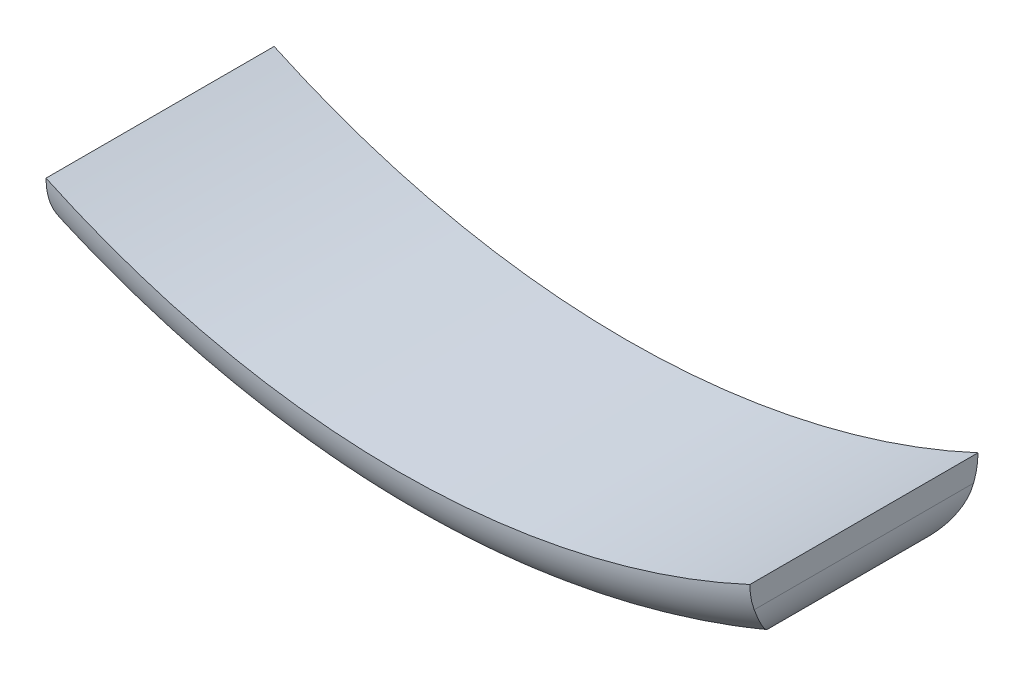
ISO-10303-21;
HEADER;
FILE_DESCRIPTION(('STEP AP214'),'2;1');
FILE_NAME('part.step','',(''),(''),'','','');
FILE_SCHEMA(('AUTOMOTIVE_DESIGN { 1 0 10303 214 1 1 1 1 }'));
ENDSEC;
DATA;
#1=APPLICATION_CONTEXT('core data for automotive mechanical design processes');
#2=APPLICATION_PROTOCOL_DEFINITION('international standard','automotive_design',2000,#1);
#3=PRODUCT_CONTEXT('',#1,'mechanical');
#4=PRODUCT('Part','Part','',(#3));
#5=PRODUCT_RELATED_PRODUCT_CATEGORY('part','',(#4));
#6=PRODUCT_DEFINITION_FORMATION('','',#4);
#7=PRODUCT_DEFINITION_CONTEXT('part definition',#1,'design');
#8=PRODUCT_DEFINITION('design','',#6,#7);
#9=PRODUCT_DEFINITION_SHAPE('','',#8);
#10=(LENGTH_UNIT() NAMED_UNIT(*) SI_UNIT(.MILLI.,.METRE.));
#11=(NAMED_UNIT(*) PLANE_ANGLE_UNIT() SI_UNIT($,.RADIAN.));
#12=(NAMED_UNIT(*) SI_UNIT($,.STERADIAN.) SOLID_ANGLE_UNIT());
#13=UNCERTAINTY_MEASURE_WITH_UNIT(LENGTH_MEASURE(1.E-05),#10,'distance_accuracy_value','');
#14=(GEOMETRIC_REPRESENTATION_CONTEXT(3) GLOBAL_UNCERTAINTY_ASSIGNED_CONTEXT((#13)) GLOBAL_UNIT_ASSIGNED_CONTEXT((#10,
#11,#12)) REPRESENTATION_CONTEXT('',''));
#15=CARTESIAN_POINT('',(0.,0.,0.));
#16=DIRECTION('',(0.,0.,1.));
#17=DIRECTION('',(1.,0.,0.));
#18=AXIS2_PLACEMENT_3D('',#15,#16,#17);
#19=CARTESIAN_POINT('',(-51.702266214,-136.538916314,-790.533090717));
#20=DIRECTION('',(0.,0.,-1.));
#21=DIRECTION('',(-1.,0.,0.));
#22=AXIS2_PLACEMENT_3D('',#19,#20,#21);
#23=CYLINDRICAL_SURFACE('',#22,9.99999999999999);
#24=DIRECTION('',(0.,0.,-1.));
#25=VECTOR('',#24,1.);
#26=CARTESIAN_POINT('',(-61.702266214,-136.538916314,-810.));
#27=LINE('',#26,#25);
#28=CARTESIAN_POINT('',(-61.702266214,-136.538916315781,-790.76392363358));
#29=VERTEX_POINT('',#28);
#30=CARTESIAN_POINT('',(-61.702266214,-136.538916317559,-829.236076365633));
#31=VERTEX_POINT('',#30);
#32=EDGE_CURVE('E142',#29,#31,#27,.T.);
#33=ORIENTED_EDGE('',*,*,#32,.T.);
#34=CARTESIAN_POINT('',(-61.702266214,-136.538916317559,-829.236076365633));
#35=CARTESIAN_POINT('',(-61.7022578830513,-136.828520241543,-829.126528882545));
#36=CARTESIAN_POINT('',(-61.6896873358878,-137.114051119616,-829.007383095938));
#37=CARTESIAN_POINT('',(-61.6415030216038,-137.675010277773,-828.752568023705));
#38=CARTESIAN_POINT('',(-61.6059340190415,-137.950457087493,-828.616931251941));
#39=CARTESIAN_POINT('',(-61.4687347356689,-138.754698450711,-828.191600548354));
#40=CARTESIAN_POINT('',(-61.3365206829346,-139.267566563795,-827.881066705212));
#41=CARTESIAN_POINT('',(-61.0661158461681,-140.063839140127,-827.341924613336));
#42=CARTESIAN_POINT('',(-60.9478163594744,-140.362535553281,-827.12491949173));
#43=CARTESIAN_POINT('',(-60.6875677874012,-140.93941073979,-826.677992277264));
#44=CARTESIAN_POINT('',(-60.5456162075812,-141.217587344578,-826.448068823684));
#45=CARTESIAN_POINT('',(-60.2401193763442,-141.754373854221,-825.97670129254));
#46=CARTESIAN_POINT('',(-60.0764632226454,-142.012871744594,-825.735202413881));
#47=CARTESIAN_POINT('',(-59.730587357344,-142.508622809219,-825.24389607616));
#48=CARTESIAN_POINT('',(-59.5483667100029,-142.745874911449,-824.994088198712));
#49=CARTESIAN_POINT('',(-59.1113508965469,-143.265902770107,-824.413337734968));
#50=CARTESIAN_POINT('',(-58.8509830645023,-143.541517833563,-824.080160204912));
#51=CARTESIAN_POINT('',(-58.3064284215977,-144.057276113727,-823.405791980209));
#52=CARTESIAN_POINT('',(-58.0222327863062,-144.297406097067,-823.064598350836));
#53=CARTESIAN_POINT('',(-57.434099251549,-144.741445520952,-822.377765160084));
#54=CARTESIAN_POINT('',(-57.1302167892222,-144.945451106927,-822.032140108124));
#55=CARTESIAN_POINT('',(-56.5049036146386,-145.317697046669,-821.33788475067));
#56=CARTESIAN_POINT('',(-56.183482081657,-145.485955887497,-820.989256096096));
#57=CARTESIAN_POINT('',(-55.658079739762,-145.725762099704,-820.431638768852));
#58=CARTESIAN_POINT('',(-55.4589744206364,-145.808956797107,-820.222997961991));
#59=CARTESIAN_POINT('',(-55.2527798441159,-145.887385572661,-820.009582821839));
#60=CARTESIAN_POINT('',(-55.2481492316041,-145.889142949817,-820.004791405609));
#61=CARTESIAN_POINT('',(-55.2435173244383,-145.890896883343,-820.000000000935));
#62=B_SPLINE_CURVE_WITH_KNOTS('',3,(#34,#35,#36,#37,#38,#39,#40,#41,#42,#43,#44,#45,#46,#47,#48,
#49,#50,#51,#52,#53,#54,#55,#56,#57,#58,#59,#60,#61),.UNSPECIFIED.,.F.,.F.,(4,2,2,2,2,2,2,2,2,2,
2,2,2,4),(0.,0.927784787002352,1.85376913309444,3.6861443693414,4.84799603119947,
6.00997030403513,7.17812868224406,8.34634597033063,9.85848511811007,11.3711867689943,
12.879799771713,14.3876306589878,15.2877806604668,15.3084542518855),.UNSPECIFIED.);
#63=CARTESIAN_POINT('',(-55.2435173501438,-145.890896874227,-820.000000002504));
#64=VERTEX_POINT('',#63);
#65=EDGE_CURVE('E133',#64,#31,#62,.F.);
#66=ORIENTED_EDGE('',*,*,#65,.F.);
#67=DIRECTION('',(0.,0.,-1.));
#68=VECTOR('',#67,1.);
#69=CARTESIAN_POINT('',(-55.2435173502066,-145.890896874265,-810.));
#70=LINE('',#69,#68);
#71=CARTESIAN_POINT('',(-55.2435173446066,-145.890896876138,-799.999999989555));
#72=VERTEX_POINT('',#71);
#73=EDGE_CURVE('E150',#64,#72,#70,.F.);
#74=ORIENTED_EDGE('',*,*,#73,.T.);
#75=CARTESIAN_POINT('',(-61.702266214,-136.538916317562,-790.76392363436));
#76=CARTESIAN_POINT('',(-61.7022578830519,-136.828520241914,-790.873471117588));
#77=CARTESIAN_POINT('',(-61.6896873358561,-137.114051120345,-790.992616904357));
#78=CARTESIAN_POINT('',(-61.6415030214501,-137.675010279204,-791.24743197696));
#79=CARTESIAN_POINT('',(-61.6059340187973,-137.950457089267,-791.383068748932));
#80=CARTESIAN_POINT('',(-61.4687347353227,-138.754698452062,-791.808399452448));
#81=CARTESIAN_POINT('',(-61.3365206827224,-139.267566564441,-792.118933295213));
#82=CARTESIAN_POINT('',(-61.0661158462443,-140.063839139889,-792.658075386469));
#83=CARTESIAN_POINT('',(-60.9478163596487,-140.362535552811,-792.875080507878));
#84=CARTESIAN_POINT('',(-60.6875677878407,-140.9394107389,-793.322007722004));
#85=CARTESIAN_POINT('',(-60.5456162081856,-141.217587343499,-793.551931175442));
#86=CARTESIAN_POINT('',(-60.2401193768806,-141.754373853295,-794.023298706476));
#87=CARTESIAN_POINT('',(-60.0764632229143,-142.012871743977,-794.264797585181));
#88=CARTESIAN_POINT('',(-59.7305873577494,-142.50862280887,-794.756103923688));
#89=CARTESIAN_POINT('',(-59.5483667108166,-142.745874911065,-795.005911801873));
#90=CARTESIAN_POINT('',(-59.1113508955161,-143.265902770578,-795.586662264039));
#91=CARTESIAN_POINT('',(-58.8509830603824,-143.541517835244,-795.919839790851));
#92=CARTESIAN_POINT('',(-58.306428425062,-144.057276112667,-796.594208024575));
#93=CARTESIAN_POINT('',(-58.0222328004383,-144.297406092037,-796.935401666223));
#94=CARTESIAN_POINT('',(-57.4340992358347,-144.741445527184,-797.622234824288));
#95=CARTESIAN_POINT('',(-57.130216733154,-144.945451128377,-797.967859831434));
#96=CARTESIAN_POINT('',(-56.5049036692447,-145.317697026083,-798.662115310546));
#97=CARTESIAN_POINT('',(-56.1834822871981,-145.485955809707,-799.010744131481));
#98=CARTESIAN_POINT('',(-55.6580796161528,-145.725762146556,-799.568361094427));
#99=CARTESIAN_POINT('',(-55.4589740466797,-145.808956938771,-799.777001624576));
#100=CARTESIAN_POINT('',(-55.2527798271962,-145.88738557911,-799.990417159382));
#101=CARTESIAN_POINT('',(-55.2481492230166,-145.88914295311,-799.995208584822));
#102=CARTESIAN_POINT('',(-55.243517324508,-145.890896883357,-799.999999999065));
#103=B_SPLINE_CURVE_WITH_KNOTS('',3,(#75,#76,#77,#78,#79,#80,#81,#82,#83,#84,#85,#86,#87,#88,
#89,#90,#91,#92,#93,#94,#95,#96,#97,#98,#99,#100,#101,#102),.UNSPECIFIED.,.F.,.F.,(4,2,2,2,2,2,
2,2,2,2,2,2,2,4),(0.,0.927784788179452,1.85376913549066,3.68614436935462,4.84799603025585,
6.00997030225449,7.1781286815019,8.34634597035146,9.8584851185325,11.3711867704889,
12.8797997727001,14.3876306589536,15.2877806604472,15.3084542518657),.UNSPECIFIED.);
#104=EDGE_CURVE('E157',#29,#72,#103,.T.);
#105=ORIENTED_EDGE('',*,*,#104,.F.);
#106=EDGE_LOOP('',(#33,#66,#74,#105));
#107=FACE_BOUND('',#106,.T.);
#108=ADVANCED_FACE('F16',(#107),#23,.T.);
#109=CARTESIAN_POINT('',(0.,0.,-800.));
#110=DIRECTION('',(0.,0.,-1.));
#111=DIRECTION('',(-1.,0.,0.));
#112=AXIS2_PLACEMENT_3D('',#109,#110,#111);
#113=CYLINDRICAL_SURFACE('',#112,156.);
#114=ORIENTED_EDGE('',*,*,#73,.F.);
#115=CARTESIAN_POINT('',(0.,2.02728112075334E-09,-820.000000005006));
#116=DIRECTION('',(0.,0.,-1.));
#117=DIRECTION('',(0.,1.,0.));
#118=AXIS2_PLACEMENT_3D('',#115,#116,#117);
#119=CIRCLE('',#118,156.000000001775);
#120=CARTESIAN_POINT('',(55.2435173299371,-145.890896881445,-820.000000007261));
#121=VERTEX_POINT('',#120);
#122=EDGE_CURVE('E84',#121,#64,#119,.T.);
#123=ORIENTED_EDGE('',*,*,#122,.F.);
#124=DIRECTION('',(0.,0.,-1.));
#125=VECTOR('',#124,1.);
#126=CARTESIAN_POINT('',(55.243517324036,-145.89089688368,-810.));
#127=LINE('',#126,#125);
#128=CARTESIAN_POINT('',(55.2435173370586,-145.890896878934,-799.999999996567));
#129=VERTEX_POINT('',#128);
#130=EDGE_CURVE('E78',#121,#129,#127,.F.);
#131=ORIENTED_EDGE('',*,*,#130,.T.);
#132=CARTESIAN_POINT('',(0.,2.02766969881196E-09,-799.999999994992));
#133=DIRECTION('',(0.,0.,1.));
#134=DIRECTION('',(0.,-1.,0.));
#135=AXIS2_PLACEMENT_3D('',#132,#133,#134);
#136=CIRCLE('',#135,156.000000001775);
#137=EDGE_CURVE('E102',#72,#129,#136,.T.);
#138=ORIENTED_EDGE('',*,*,#137,.F.);
#139=EDGE_LOOP('',(#114,#123,#131,#138));
#140=FACE_BOUND('',#139,.T.);
#141=ADVANCED_FACE('F159',(#140),#113,.T.);
#142=CARTESIAN_POINT('',(51.702266214,-136.538916314,-790.533090717));
#143=DIRECTION('',(0.,0.,-1.));
#144=DIRECTION('',(-1.,0.,0.));
#145=AXIS2_PLACEMENT_3D('',#142,#143,#144);
#146=CYLINDRICAL_SURFACE('',#145,10.);
#147=DIRECTION('',(0.,0.,1.));
#148=VECTOR('',#147,1.);
#149=CARTESIAN_POINT('',(61.702266214,-136.538916314,-810.));
#150=LINE('',#149,#148);
#151=CARTESIAN_POINT('',(61.702266214,-136.538916316691,-829.236076366072));
#152=VERTEX_POINT('',#151);
#153=CARTESIAN_POINT('',(61.702266214,-136.538916319385,-790.76392363505));
#154=VERTEX_POINT('',#153);
#155=EDGE_CURVE('E76',#152,#154,#150,.T.);
#156=ORIENTED_EDGE('',*,*,#155,.T.);
#157=CARTESIAN_POINT('',(61.7022662085975,-136.538916317755,-790.76392363936));
#158=CARTESIAN_POINT('',(61.7022578810028,-136.828520243364,-790.873471120003));
#159=CARTESIAN_POINT('',(61.6896873351878,-137.114051122328,-790.992616905713));
#160=CARTESIAN_POINT('',(61.6415030217514,-137.675010281482,-791.247431977541));
#161=CARTESIAN_POINT('',(61.6059340186995,-137.950457091313,-791.383068749787));
#162=CARTESIAN_POINT('',(61.4687347345939,-138.754698453422,-791.808399453616));
#163=CARTESIAN_POINT('',(61.3365206823055,-139.267566565546,-792.118933296));
#164=CARTESIAN_POINT('',(61.0661158459974,-140.063839140694,-792.658075386989));
#165=CARTESIAN_POINT('',(60.9478163593439,-140.362535553584,-792.875080508438));
#166=CARTESIAN_POINT('',(60.6875677874784,-140.939410739606,-793.32200772259));
#167=CARTESIAN_POINT('',(60.5456162078252,-141.217587344171,-793.551931176012));
#168=CARTESIAN_POINT('',(60.2401193764905,-141.754373853942,-794.023298707063));
#169=CARTESIAN_POINT('',(60.076463222489,-142.012871744631,-794.264797585802));
#170=CARTESIAN_POINT('',(59.7305873572503,-142.508622809542,-794.75610392438));
#171=CARTESIAN_POINT('',(59.5483667102784,-142.745874911746,-795.005911802603));
#172=CARTESIAN_POINT('',(59.1113508948964,-143.265902771262,-795.586662264843));
#173=CARTESIAN_POINT('',(58.8509830597207,-143.541517835921,-795.91983979169));
#174=CARTESIAN_POINT('',(58.3064284243178,-144.057276113322,-796.594208025478));
#175=CARTESIAN_POINT('',(58.022232799654,-144.297406092676,-796.935401667154));
#176=CARTESIAN_POINT('',(57.4340992349912,-144.741445527774,-797.622234825258));
#177=CARTESIAN_POINT('',(57.1302167322928,-144.945451128934,-797.967859832413));
#178=CARTESIAN_POINT('',(56.5049036683388,-145.317697026578,-798.662115311529));
#179=CARTESIAN_POINT('',(56.1834822862653,-145.485955810173,-799.010744132461));
#180=CARTESIAN_POINT('',(55.6580796155251,-145.725762146819,-799.568361095099));
#181=CARTESIAN_POINT('',(55.4589740463794,-145.808956938885,-799.777001624931));
#182=CARTESIAN_POINT('',(55.2527798271972,-145.88738557911,-799.990417159383));
#183=CARTESIAN_POINT('',(55.2481492230171,-145.88914295311,-799.995208584823));
#184=CARTESIAN_POINT('',(55.243517324508,-145.890896883357,-799.999999999065));
#185=B_SPLINE_CURVE_WITH_KNOTS('',3,(#157,#158,#159,#160,#161,#162,#163,#164,#165,#166,#167,
#168,#169,#170,#171,#172,#173,#174,#175,#176,#177,#178,#179,#180,#181,#182,#183,#184),
.UNSPECIFIED.,.F.,.F.,(4,2,2,2,2,2,2,2,2,2,2,2,2,4),(0.,0.927784788270664,1.85376913532276,
3.68614436805434,4.84799602895267,6.00997030086551,7.17812868022746,8.34634596922498,
9.85848511752728,11.3711867695888,12.8797997718106,14.3876306580784,15.2877806581375,
15.308454249556),.UNSPECIFIED.);
#186=EDGE_CURVE('E97',#129,#154,#185,.F.);
#187=ORIENTED_EDGE('',*,*,#186,.F.);
#188=ORIENTED_EDGE('',*,*,#130,.F.);
#189=CARTESIAN_POINT('',(61.7022662086009,-136.538916317754,-829.236076360637));
#190=CARTESIAN_POINT('',(61.7022578810034,-136.828520242993,-829.126528880131));
#191=CARTESIAN_POINT('',(61.6896873352199,-137.114051121599,-829.007383094582));
#192=CARTESIAN_POINT('',(61.6415030219048,-137.675010280051,-828.752568023124));
#193=CARTESIAN_POINT('',(61.6059340189436,-137.950457089538,-828.616931251086));
#194=CARTESIAN_POINT('',(61.4687347349404,-138.754698452071,-828.191600547186));
#195=CARTESIAN_POINT('',(61.3365206825177,-139.267566564901,-827.881066704424));
#196=CARTESIAN_POINT('',(61.0661158459208,-140.063839140932,-827.341924612816));
#197=CARTESIAN_POINT('',(60.9478163591694,-140.362535554055,-827.124919491169));
#198=CARTESIAN_POINT('',(60.6875677870384,-140.939410740497,-826.677992276677));
#199=CARTESIAN_POINT('',(60.5456162072203,-141.21758734525,-826.448068823113));
#200=CARTESIAN_POINT('',(60.2401193759535,-141.754373854869,-825.976701291951));
#201=CARTESIAN_POINT('',(60.0764632222196,-142.012871745249,-825.735202413259));
#202=CARTESIAN_POINT('',(59.7305873568443,-142.508622809891,-825.243896075467));
#203=CARTESIAN_POINT('',(59.548366709464,-142.745874912131,-824.994088197981));
#204=CARTESIAN_POINT('',(59.1113508959269,-143.265902770792,-824.413337734164));
#205=CARTESIAN_POINT('',(58.8509830638409,-143.54151783424,-824.080160204072));
#206=CARTESIAN_POINT('',(58.3064284208522,-144.057276114382,-823.405791979307));
#207=CARTESIAN_POINT('',(58.0222327855181,-144.297406097708,-823.064598349908));
#208=CARTESIAN_POINT('',(57.4340992507083,-144.74144552154,-822.37776515911));
#209=CARTESIAN_POINT('',(57.1302167883728,-144.94545110748,-822.032140107131));
#210=CARTESIAN_POINT('',(56.5049036137197,-145.317697047169,-821.3378847497));
#211=CARTESIAN_POINT('',(56.1834820806774,-145.485955887981,-820.989256095166));
#212=CARTESIAN_POINT('',(55.6580797391611,-145.725762099956,-820.431638768148));
#213=CARTESIAN_POINT('',(55.4589744204189,-145.80895679719,-820.222997961543));
#214=CARTESIAN_POINT('',(55.2527798441206,-145.887385572659,-820.009582821834));
#215=CARTESIAN_POINT('',(55.2481492316065,-145.889142949816,-820.004791405606));
#216=CARTESIAN_POINT('',(55.2435173244383,-145.890896883343,-820.000000000935));
#217=B_SPLINE_CURVE_WITH_KNOTS('',3,(#189,#190,#191,#192,#193,#194,#195,#196,#197,#198,#199,
#200,#201,#202,#203,#204,#205,#206,#207,#208,#209,#210,#211,#212,#213,#214,#215,#216),
.UNSPECIFIED.,.F.,.F.,(4,2,2,2,2,2,2,2,2,2,2,2,2,4),(0.,0.927784787093349,1.85376913292636,
3.68614436804222,4.8479960298979,6.00997030264789,7.17812868097101,8.34634596920541,
9.85848511710593,11.3711867680952,12.8797997708249,14.3876306581143,15.2877806581574,
15.3084542495762),.UNSPECIFIED.);
#218=EDGE_CURVE('E21',#152,#121,#217,.T.);
#219=ORIENTED_EDGE('',*,*,#218,.F.);
#220=EDGE_LOOP('',(#156,#187,#188,#219));
#221=FACE_BOUND('',#220,.T.);
#222=ADVANCED_FACE('F74',(#221),#146,.T.);
#223=CARTESIAN_POINT('',(0.,2.62900812231237E-09,-820.000000000935));
#224=DIRECTION('',(0.,0.,1.));
#225=DIRECTION('',(0.,-1.,0.));
#226=AXIS2_PLACEMENT_3D('',#223,#224,#225);
#227=TOROIDAL_SURFACE('',#226,146.000000001742,9.99999999990753);
#228=CARTESIAN_POINT('',(0.,0.,-830.));
#229=DIRECTION('',(0.,0.,-1.));
#230=DIRECTION('',(-1.,0.,0.));
#231=AXIS2_PLACEMENT_3D('',#228,#229,#230);
#232=CIRCLE('',#231,146.);
#233=CARTESIAN_POINT('',(61.7022662396161,-132.320936892639,-830.000000000421));
#234=VERTEX_POINT('',#233);
#235=CARTESIAN_POINT('',(-61.7022661887136,-132.320936919208,-830.));
#236=VERTEX_POINT('',#235);
#237=EDGE_CURVE('E95',#234,#236,#232,.T.);
#238=ORIENTED_EDGE('',*,*,#237,.F.);
#239=CARTESIAN_POINT('',(61.7022662196901,-132.320936901751,-830.000000006532));
#240=CARTESIAN_POINT('',(61.7022662160473,-132.68152778242,-830.000017143602));
#241=CARTESIAN_POINT('',(61.7022662145492,-133.042138231139,-829.983978796865));
#242=CARTESIAN_POINT('',(61.7022662134553,-133.757581031264,-829.920036375254));
#243=CARTESIAN_POINT('',(61.7022662138443,-134.112436526902,-829.872390712619));
#244=CARTESIAN_POINT('',(61.7022662141557,-134.816504616677,-829.745471349256));
#245=CARTESIAN_POINT('',(61.7022662140782,-135.165716657792,-829.666194568211));
#246=CARTESIAN_POINT('',(61.7022662139212,-135.858283262363,-829.475433509933));
#247=CARTESIAN_POINT('',(61.7022662138417,-136.201566971397,-829.363692220374));
#248=CARTESIAN_POINT('',(61.702266214,-136.538916317754,-829.23607636556));
#249=B_SPLINE_CURVE_WITH_KNOTS('',3,(#239,#240,#241,#242,#243,#244,#245,#246,#247,#248),
.UNSPECIFIED.,.F.,.F.,(4,2,2,2,4),(0.,1.08144436592851,2.15415436202908,3.22696884682379,
4.30851937812935),.UNSPECIFIED.);
#250=EDGE_CURVE('E88',#234,#152,#249,.T.);
#251=ORIENTED_EDGE('',*,*,#250,.T.);
#252=ORIENTED_EDGE('',*,*,#218,.T.);
#253=ORIENTED_EDGE('',*,*,#122,.T.);
#254=ORIENTED_EDGE('',*,*,#65,.T.);
#255=CARTESIAN_POINT('',(-61.702266214,-136.538916317559,-829.236076365633));
#256=CARTESIAN_POINT('',(-61.702266214,-136.201566973135,-829.36369221987));
#257=CARTESIAN_POINT('',(-61.702266214,-135.85828326609,-829.475433508796));
#258=CARTESIAN_POINT('',(-61.702266214,-135.165716665617,-829.666194566165));
#259=CARTESIAN_POINT('',(-61.702266214,-134.816504626609,-829.745471346936));
#260=CARTESIAN_POINT('',(-61.702266214,-134.112436540983,-829.87239071061));
#261=CARTESIAN_POINT('',(-61.702266214,-133.757581047384,-829.92003637382));
#262=CARTESIAN_POINT('',(-61.702266214,-133.042138251201,-829.983978795065));
#263=CARTESIAN_POINT('',(-61.702266214,-132.681527804383,-830.000017140843));
#264=CARTESIAN_POINT('',(-61.702266214,-132.320936925487,-830.000000000842));
#265=B_SPLINE_CURVE_WITH_KNOTS('',3,(#255,#256,#257,#258,#259,#260,#261,#262,#263,#264),
.UNSPECIFIED.,.F.,.F.,(4,2,2,2,4),(0.,1.08155052513068,2.15436500364293,3.22707499383015,
4.30851935395599),.UNSPECIFIED.);
#266=EDGE_CURVE('E128',#31,#236,#265,.T.);
#267=ORIENTED_EDGE('',*,*,#266,.T.);
#268=EDGE_LOOP('',(#238,#251,#252,#253,#254,#267));
#269=FACE_BOUND('',#268,.T.);
#270=ADVANCED_FACE('F93',(#269),#227,.T.);
#271=CARTESIAN_POINT('',(-61.702266214,-136.538916314,-830.24));
#272=DIRECTION('',(1.,0.,0.));
#273=DIRECTION('',(0.,1.,0.));
#274=AXIS2_PLACEMENT_3D('',#271,#272,#273);
#275=PLANE('',#274);
#276=CARTESIAN_POINT('',(-61.702266214,-132.320936925487,-789.999999999158));
#277=CARTESIAN_POINT('',(-61.702266214,-132.681527804383,-789.999982859157));
#278=CARTESIAN_POINT('',(-61.702266214,-133.042138251201,-790.016021204935));
#279=CARTESIAN_POINT('',(-61.702266214,-133.757581047385,-790.079963626179));
#280=CARTESIAN_POINT('',(-61.702266214,-134.112436540984,-790.127609289388));
#281=CARTESIAN_POINT('',(-61.702266214,-134.81650462661,-790.254528653061));
#282=CARTESIAN_POINT('',(-61.702266214,-135.165716665618,-790.333805433831));
#283=CARTESIAN_POINT('',(-61.702266214,-135.858283266092,-790.524566491199));
#284=CARTESIAN_POINT('',(-61.702266214,-136.201566973137,-790.636307780125));
#285=CARTESIAN_POINT('',(-61.702266214,-136.538916317562,-790.76392363436));
#286=B_SPLINE_CURVE_WITH_KNOTS('',3,(#276,#277,#278,#279,#280,#281,#282,#283,#284,#285),
.UNSPECIFIED.,.F.,.F.,(4,2,2,2,4),(0.,1.08144436012609,2.15415435031354,3.2269688288261,
4.30851935395701),.UNSPECIFIED.);
#287=CARTESIAN_POINT('',(-61.7022661887136,-132.320936928243,-789.999999999579));
#288=VERTEX_POINT('',#287);
#289=EDGE_CURVE('E165',#288,#29,#286,.T.);
#290=ORIENTED_EDGE('',*,*,#289,.F.);
#291=DIRECTION('',(0.,0.,-1.));
#292=VECTOR('',#291,1.);
#293=CARTESIAN_POINT('',(-61.7022661634272,-132.320936931,-810.));
#294=LINE('',#293,#292);
#295=EDGE_CURVE('E168',#236,#288,#294,.F.);
#296=ORIENTED_EDGE('',*,*,#295,.F.);
#297=ORIENTED_EDGE('',*,*,#266,.F.);
#298=ORIENTED_EDGE('',*,*,#32,.F.);
#299=EDGE_LOOP('',(#290,#296,#297,#298));
#300=FACE_BOUND('',#299,.T.);
#301=ADVANCED_FACE('F120',(#300),#275,.F.);
#302=CARTESIAN_POINT('',(0.,1.58817403672629E-10,-799.999999999066));
#303=DIRECTION('',(0.,0.,1.));
#304=DIRECTION('',(0.,-1.,0.));
#305=AXIS2_PLACEMENT_3D('',#302,#303,#304);
#306=TOROIDAL_SURFACE('',#305,145.999999999509,9.99999999990739);
#307=ORIENTED_EDGE('',*,*,#186,.T.);
#308=CARTESIAN_POINT('',(61.7022662085975,-136.538916317755,-790.76392363936));
#309=CARTESIAN_POINT('',(61.7022662120562,-136.201566971999,-790.636307781408));
#310=CARTESIAN_POINT('',(61.7022662134786,-135.858283263002,-790.524566490633));
#311=CARTESIAN_POINT('',(61.7022662145172,-135.165716658166,-790.333805431496));
#312=CARTESIAN_POINT('',(61.7022662141478,-134.816504616755,-790.25452865078));
#313=CARTESIAN_POINT('',(61.7022662138522,-134.112436526511,-790.127609287284));
#314=CARTESIAN_POINT('',(61.7022662139258,-133.757581030698,-790.079963624186));
#315=CARTESIAN_POINT('',(61.7022662140748,-133.042138229981,-790.016021203543));
#316=CARTESIAN_POINT('',(61.7022662141502,-132.681527780841,-789.999982858267));
#317=CARTESIAN_POINT('',(61.702266214,-132.320936899599,-789.999999999158));
#318=B_SPLINE_CURVE_WITH_KNOTS('',3,(#308,#309,#310,#311,#312,#313,#314,#315,#316,#317),
.UNSPECIFIED.,.F.,.F.,(4,2,2,2,4),(0.,1.08155053238853,2.15436501777983,3.2270750145123,
4.30851938155243),.UNSPECIFIED.);
#319=CARTESIAN_POINT('',(61.7022662396161,-132.320936895472,-790.));
#320=VERTEX_POINT('',#319);
#321=EDGE_CURVE('E89',#154,#320,#318,.T.);
#322=ORIENTED_EDGE('',*,*,#321,.T.);
#323=CARTESIAN_POINT('',(0.,0.,-790.));
#324=DIRECTION('',(0.,0.,-1.));
#325=DIRECTION('',(-1.,0.,0.));
#326=AXIS2_PLACEMENT_3D('',#323,#324,#325);
#327=CIRCLE('',#326,146.);
#328=EDGE_CURVE('E33',#288,#320,#327,.F.);
#329=ORIENTED_EDGE('',*,*,#328,.F.);
#330=ORIENTED_EDGE('',*,*,#289,.T.);
#331=ORIENTED_EDGE('',*,*,#104,.T.);
#332=ORIENTED_EDGE('',*,*,#137,.T.);
#333=EDGE_LOOP('',(#307,#322,#329,#330,#331,#332));
#334=FACE_BOUND('',#333,.T.);
#335=ADVANCED_FACE('F172',(#334),#306,.T.);
#336=CARTESIAN_POINT('',(61.702266214,-132.320936907,-830.24));
#337=DIRECTION('',(-1.,0.,0.));
#338=DIRECTION('',(0.,-1.,0.));
#339=AXIS2_PLACEMENT_3D('',#336,#337,#338);
#340=PLANE('',#339);
#341=ORIENTED_EDGE('',*,*,#321,.F.);
#342=ORIENTED_EDGE('',*,*,#155,.F.);
#343=ORIENTED_EDGE('',*,*,#250,.F.);
#344=DIRECTION('',(0.,0.,1.));
#345=VECTOR('',#344,1.);
#346=CARTESIAN_POINT('',(61.7022662652322,-132.320936883527,-810.));
#347=LINE('',#346,#345);
#348=EDGE_CURVE('E11',#320,#234,#347,.F.);
#349=ORIENTED_EDGE('',*,*,#348,.F.);
#350=EDGE_LOOP('',(#341,#342,#343,#349));
#351=FACE_BOUND('',#350,.T.);
#352=ADVANCED_FACE('F18',(#351),#340,.F.);
#353=CARTESIAN_POINT('',(0.,0.,-790.));
#354=DIRECTION('',(0.,0.,-1.));
#355=DIRECTION('',(0.,1.,0.));
#356=AXIS2_PLACEMENT_3D('',#353,#354,#355);
#357=CYLINDRICAL_SURFACE('',#356,146.);
#358=ORIENTED_EDGE('',*,*,#328,.T.);
#359=ORIENTED_EDGE('',*,*,#348,.T.);
#360=ORIENTED_EDGE('',*,*,#237,.T.);
#361=ORIENTED_EDGE('',*,*,#295,.T.);
#362=EDGE_LOOP('',(#358,#359,#360,#361));
#363=FACE_BOUND('',#362,.T.);
#364=ADVANCED_FACE('F174',(#363),#357,.F.);
#365=CLOSED_SHELL('',(#108,#141,#222,#270,#301,#335,#352,#364));
#366=MANIFOLD_SOLID_BREP('B1',#365);
#367=ADVANCED_BREP_SHAPE_REPRESENTATION('',(#18,#366),#14);
#368=SHAPE_DEFINITION_REPRESENTATION(#9,#367);
ENDSEC;
END-ISO-10303-21;
